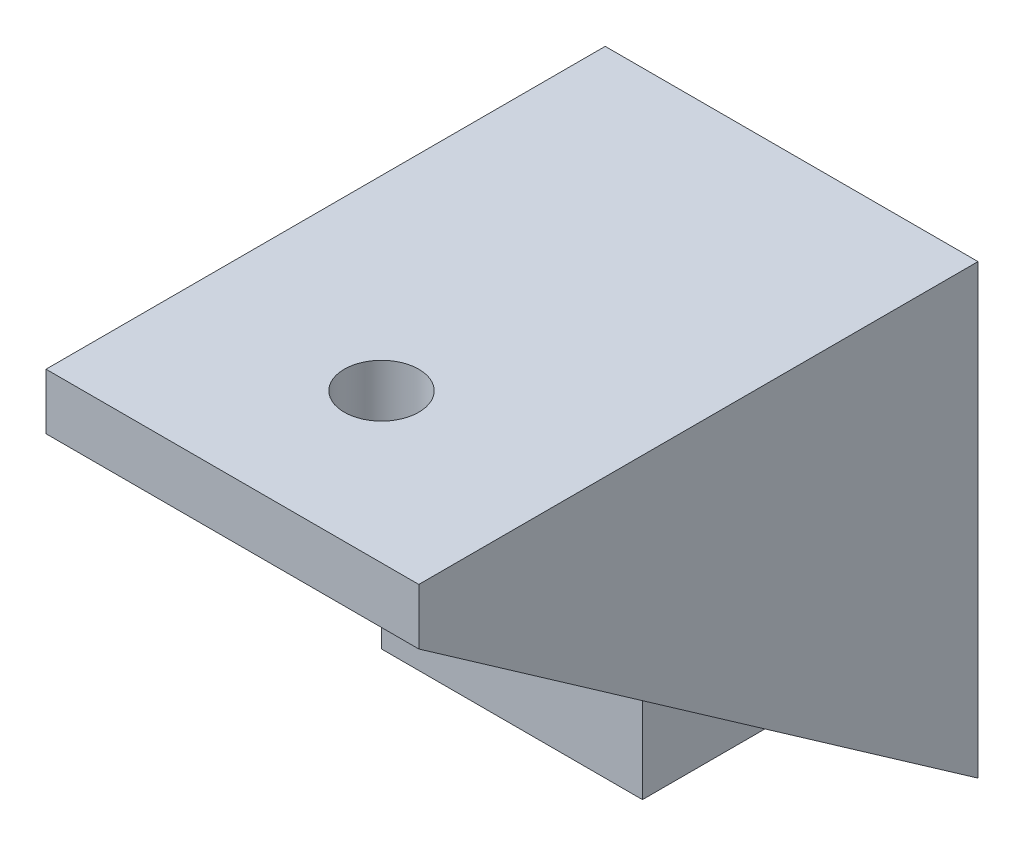
ISO-10303-21;
HEADER;
FILE_DESCRIPTION(('STEP AP214'),'2;1');
FILE_NAME('part.step','',(''),(''),'','','');
FILE_SCHEMA(('AUTOMOTIVE_DESIGN { 1 0 10303 214 1 1 1 1 }'));
ENDSEC;
DATA;
#1=APPLICATION_CONTEXT('core data for automotive mechanical design processes');
#2=APPLICATION_PROTOCOL_DEFINITION('international standard','automotive_design',2000,#1);
#3=PRODUCT_CONTEXT('',#1,'mechanical');
#4=PRODUCT('Part','Part','',(#3));
#5=PRODUCT_RELATED_PRODUCT_CATEGORY('part','',(#4));
#6=PRODUCT_DEFINITION_FORMATION('','',#4);
#7=PRODUCT_DEFINITION_CONTEXT('part definition',#1,'design');
#8=PRODUCT_DEFINITION('design','',#6,#7);
#9=PRODUCT_DEFINITION_SHAPE('','',#8);
#10=(LENGTH_UNIT() NAMED_UNIT(*) SI_UNIT(.MILLI.,.METRE.));
#11=(NAMED_UNIT(*) PLANE_ANGLE_UNIT() SI_UNIT($,.RADIAN.));
#12=(NAMED_UNIT(*) SI_UNIT($,.STERADIAN.) SOLID_ANGLE_UNIT());
#13=UNCERTAINTY_MEASURE_WITH_UNIT(LENGTH_MEASURE(1.E-05),#10,'distance_accuracy_value','');
#14=(GEOMETRIC_REPRESENTATION_CONTEXT(3) GLOBAL_UNCERTAINTY_ASSIGNED_CONTEXT((#13)) GLOBAL_UNIT_ASSIGNED_CONTEXT((#10,
#11,#12)) REPRESENTATION_CONTEXT('',''));
#15=CARTESIAN_POINT('',(0.,0.,0.));
#16=DIRECTION('',(0.,0.,1.));
#17=DIRECTION('',(1.,0.,0.));
#18=AXIS2_PLACEMENT_3D('',#15,#16,#17);
#19=CARTESIAN_POINT('',(0.,0.,3.));
#20=DIRECTION('',(0.,0.,1.));
#21=DIRECTION('',(1.,0.,0.));
#22=AXIS2_PLACEMENT_3D('',#19,#20,#21);
#23=PLANE('',#22);
#24=DIRECTION('',(1.,0.,0.));
#25=VECTOR('',#24,1.);
#26=CARTESIAN_POINT('',(-10.,-9.9,3.));
#27=LINE('',#26,#25);
#28=CARTESIAN_POINT('',(-8.,-9.9,3.));
#29=VERTEX_POINT('',#28);
#30=CARTESIAN_POINT('',(8.,-9.9,3.));
#31=VERTEX_POINT('',#30);
#32=EDGE_CURVE('E192',#29,#31,#27,.T.);
#33=ORIENTED_EDGE('',*,*,#32,.T.);
#34=DIRECTION('',(0.,-1.,0.));
#35=VECTOR('',#34,1.);
#36=CARTESIAN_POINT('',(8.,0.,3.));
#37=LINE('',#36,#35);
#38=CARTESIAN_POINT('',(8.,9.,3.));
#39=VERTEX_POINT('',#38);
#40=EDGE_CURVE('E144',#39,#31,#37,.T.);
#41=ORIENTED_EDGE('',*,*,#40,.F.);
#42=DIRECTION('',(1.,0.,0.));
#43=VECTOR('',#42,1.);
#44=CARTESIAN_POINT('',(0.,9.,3.));
#45=LINE('',#44,#43);
#46=CARTESIAN_POINT('',(-8.,9.,3.));
#47=VERTEX_POINT('',#46);
#48=EDGE_CURVE('E151',#47,#39,#45,.T.);
#49=ORIENTED_EDGE('',*,*,#48,.F.);
#50=DIRECTION('',(0.,-1.,0.));
#51=VECTOR('',#50,1.);
#52=CARTESIAN_POINT('',(-8.,0.,3.));
#53=LINE('',#52,#51);
#54=EDGE_CURVE('E153',#47,#29,#53,.T.);
#55=ORIENTED_EDGE('',*,*,#54,.T.);
#56=EDGE_LOOP('',(#33,#41,#49,#55));
#57=FACE_BOUND('',#56,.T.);
#58=DIRECTION('',(-1.,0.,0.));
#59=VECTOR('',#58,1.);
#60=CARTESIAN_POINT('',(-7.,7.,3.));
#61=LINE('',#60,#59);
#62=CARTESIAN_POINT('',(7.,7.,3.));
#63=VERTEX_POINT('',#62);
#64=CARTESIAN_POINT('',(-7.,7.,3.));
#65=VERTEX_POINT('',#64);
#66=EDGE_CURVE('E271',#63,#65,#61,.T.);
#67=ORIENTED_EDGE('',*,*,#66,.F.);
#68=DIRECTION('',(0.,1.,0.));
#69=VECTOR('',#68,1.);
#70=CARTESIAN_POINT('',(7.,-7.,3.));
#71=LINE('',#70,#69);
#72=CARTESIAN_POINT('',(7.,-7.,3.));
#73=VERTEX_POINT('',#72);
#74=EDGE_CURVE('E139',#73,#63,#71,.T.);
#75=ORIENTED_EDGE('',*,*,#74,.F.);
#76=DIRECTION('',(1.,0.,0.));
#77=VECTOR('',#76,1.);
#78=CARTESIAN_POINT('',(-7.,-7.,3.));
#79=LINE('',#78,#77);
#80=CARTESIAN_POINT('',(-7.,-7.,3.));
#81=VERTEX_POINT('',#80);
#82=EDGE_CURVE('E135',#81,#73,#79,.T.);
#83=ORIENTED_EDGE('',*,*,#82,.F.);
#84=DIRECTION('',(0.,-1.,0.));
#85=VECTOR('',#84,1.);
#86=CARTESIAN_POINT('',(-7.,-7.,3.));
#87=LINE('',#86,#85);
#88=EDGE_CURVE('E273',#65,#81,#87,.T.);
#89=ORIENTED_EDGE('',*,*,#88,.F.);
#90=EDGE_LOOP('',(#67,#75,#83,#89));
#91=FACE_BOUND('',#90,.T.);
#92=ADVANCED_FACE('F32',(#57,#91),#23,.T.);
#93=CARTESIAN_POINT('',(-10.,-12.,0.));
#94=DIRECTION('',(0.,0.81923192051904,-0.573462344363328));
#95=DIRECTION('',(0.,0.573462344363328,0.81923192051904));
#96=AXIS2_PLACEMENT_3D('',#93,#94,#95);
#97=PLANE('',#96);
#98=DIRECTION('',(0.,0.573462344363328,0.81923192051904));
#99=VECTOR('',#98,1.);
#100=CARTESIAN_POINT('',(8.,-12.,0.));
#101=LINE('',#100,#99);
#102=CARTESIAN_POINT('',(7.99999999999999,9.,30.));
#103=VERTEX_POINT('',#102);
#104=EDGE_CURVE('E11',#31,#103,#101,.T.);
#105=ORIENTED_EDGE('',*,*,#104,.F.);
#106=ORIENTED_EDGE('',*,*,#32,.F.);
#107=DIRECTION('',(0.,0.573462344363328,0.81923192051904));
#108=VECTOR('',#107,1.);
#109=CARTESIAN_POINT('',(-8.,-12.,0.));
#110=LINE('',#109,#108);
#111=CARTESIAN_POINT('',(-8.,9.,30.));
#112=VERTEX_POINT('',#111);
#113=EDGE_CURVE('E41',#29,#112,#110,.T.);
#114=ORIENTED_EDGE('',*,*,#113,.T.);
#115=DIRECTION('',(1.,0.,0.));
#116=VECTOR('',#115,1.);
#117=CARTESIAN_POINT('',(-10.,9.,30.));
#118=LINE('',#117,#116);
#119=CARTESIAN_POINT('',(-10.,9.,30.));
#120=VERTEX_POINT('',#119);
#121=EDGE_CURVE('E166',#120,#112,#118,.T.);
#122=ORIENTED_EDGE('',*,*,#121,.F.);
#123=DIRECTION('',(0.,0.573462344363328,0.81923192051904));
#124=VECTOR('',#123,1.);
#125=CARTESIAN_POINT('',(-10.,-12.,0.));
#126=LINE('',#125,#124);
#127=CARTESIAN_POINT('',(-10.,-12.,0.));
#128=VERTEX_POINT('',#127);
#129=EDGE_CURVE('E160',#128,#120,#126,.T.);
#130=ORIENTED_EDGE('',*,*,#129,.F.);
#131=DIRECTION('',(1.,0.,0.));
#132=VECTOR('',#131,1.);
#133=CARTESIAN_POINT('',(-10.,-12.,0.));
#134=LINE('',#133,#132);
#135=CARTESIAN_POINT('',(10.,-12.,0.));
#136=VERTEX_POINT('',#135);
#137=EDGE_CURVE('E173',#128,#136,#134,.T.);
#138=ORIENTED_EDGE('',*,*,#137,.T.);
#139=DIRECTION('',(0.,0.573462344363328,0.81923192051904));
#140=VECTOR('',#139,1.);
#141=CARTESIAN_POINT('',(10.,-12.,0.));
#142=LINE('',#141,#140);
#143=CARTESIAN_POINT('',(10.,9.,30.));
#144=VERTEX_POINT('',#143);
#145=EDGE_CURVE('E158',#136,#144,#142,.T.);
#146=ORIENTED_EDGE('',*,*,#145,.T.);
#147=EDGE_CURVE('E163',#103,#144,#118,.T.);
#148=ORIENTED_EDGE('',*,*,#147,.F.);
#149=EDGE_LOOP('',(#105,#106,#114,#122,#130,#138,#146,#148));
#150=FACE_BOUND('',#149,.T.);
#151=ADVANCED_FACE('F198',(#150),#97,.F.);
#152=CARTESIAN_POINT('',(10.,-12.,30.));
#153=DIRECTION('',(-1.,0.,0.));
#154=DIRECTION('',(0.,0.,1.));
#155=AXIS2_PLACEMENT_3D('',#152,#153,#154);
#156=PLANE('',#155);
#157=DIRECTION('',(0.,1.,0.));
#158=VECTOR('',#157,1.);
#159=CARTESIAN_POINT('',(10.,-12.,30.));
#160=LINE('',#159,#158);
#161=CARTESIAN_POINT('',(10.,12.,30.));
#162=VERTEX_POINT('',#161);
#163=EDGE_CURVE('E170',#144,#162,#160,.T.);
#164=ORIENTED_EDGE('',*,*,#163,.F.);
#165=ORIENTED_EDGE('',*,*,#145,.F.);
#166=DIRECTION('',(0.,1.,0.));
#167=VECTOR('',#166,1.);
#168=CARTESIAN_POINT('',(10.,-12.,0.));
#169=LINE('',#168,#167);
#170=CARTESIAN_POINT('',(10.,12.,0.));
#171=VERTEX_POINT('',#170);
#172=EDGE_CURVE('E169',#136,#171,#169,.T.);
#173=ORIENTED_EDGE('',*,*,#172,.T.);
#174=DIRECTION('',(0.,0.,-1.));
#175=VECTOR('',#174,1.);
#176=CARTESIAN_POINT('',(10.,12.,30.));
#177=LINE('',#176,#175);
#178=EDGE_CURVE('E189',#162,#171,#177,.T.);
#179=ORIENTED_EDGE('',*,*,#178,.F.);
#180=EDGE_LOOP('',(#164,#165,#173,#179));
#181=FACE_BOUND('',#180,.T.);
#182=ADVANCED_FACE('F34',(#181),#156,.F.);
#183=CARTESIAN_POINT('',(-10.,12.,30.));
#184=DIRECTION('',(0.,-1.,0.));
#185=DIRECTION('',(0.,0.,-1.));
#186=AXIS2_PLACEMENT_3D('',#183,#184,#185);
#187=PLANE('',#186);
#188=CARTESIAN_POINT('',(0.,12.,22.));
#189=DIRECTION('',(0.,-1.,0.));
#190=DIRECTION('',(0.,0.,-1.));
#191=AXIS2_PLACEMENT_3D('',#188,#189,#190);
#192=CIRCLE('',#191,2.);
#193=CARTESIAN_POINT('',(0.,12.,20.));
#194=VERTEX_POINT('',#193);
#195=EDGE_CURVE('E260',#194,#194,#192,.T.);
#196=ORIENTED_EDGE('',*,*,#195,.T.);
#197=EDGE_LOOP('',(#196));
#198=FACE_BOUND('',#197,.T.);
#199=DIRECTION('',(-1.,0.,0.));
#200=VECTOR('',#199,1.);
#201=CARTESIAN_POINT('',(-10.,12.,0.));
#202=LINE('',#201,#200);
#203=CARTESIAN_POINT('',(-10.,12.,0.));
#204=VERTEX_POINT('',#203);
#205=EDGE_CURVE('E181',#171,#204,#202,.T.);
#206=ORIENTED_EDGE('',*,*,#205,.T.);
#207=DIRECTION('',(0.,0.,-1.));
#208=VECTOR('',#207,1.);
#209=CARTESIAN_POINT('',(-10.,12.,30.));
#210=LINE('',#209,#208);
#211=CARTESIAN_POINT('',(-10.,12.,30.));
#212=VERTEX_POINT('',#211);
#213=EDGE_CURVE('E178',#212,#204,#210,.T.);
#214=ORIENTED_EDGE('',*,*,#213,.F.);
#215=DIRECTION('',(-1.,0.,0.));
#216=VECTOR('',#215,1.);
#217=CARTESIAN_POINT('',(-10.,12.,30.));
#218=LINE('',#217,#216);
#219=EDGE_CURVE('E172',#162,#212,#218,.T.);
#220=ORIENTED_EDGE('',*,*,#219,.F.);
#221=ORIENTED_EDGE('',*,*,#178,.T.);
#222=EDGE_LOOP('',(#206,#214,#220,#221));
#223=FACE_BOUND('',#222,.T.);
#224=ADVANCED_FACE('F219',(#198,#223),#187,.F.);
#225=CARTESIAN_POINT('',(-10.,-12.,30.));
#226=DIRECTION('',(1.,0.,0.));
#227=DIRECTION('',(0.,0.,-1.));
#228=AXIS2_PLACEMENT_3D('',#225,#226,#227);
#229=PLANE('',#228);
#230=DIRECTION('',(0.,-1.,0.));
#231=VECTOR('',#230,1.);
#232=CARTESIAN_POINT('',(-10.,-12.,0.));
#233=LINE('',#232,#231);
#234=EDGE_CURVE('E183',#204,#128,#233,.T.);
#235=ORIENTED_EDGE('',*,*,#234,.T.);
#236=ORIENTED_EDGE('',*,*,#129,.T.);
#237=DIRECTION('',(0.,-1.,0.));
#238=VECTOR('',#237,1.);
#239=CARTESIAN_POINT('',(-10.,-12.,30.));
#240=LINE('',#239,#238);
#241=EDGE_CURVE('E175',#212,#120,#240,.T.);
#242=ORIENTED_EDGE('',*,*,#241,.F.);
#243=ORIENTED_EDGE('',*,*,#213,.T.);
#244=EDGE_LOOP('',(#235,#236,#242,#243));
#245=FACE_BOUND('',#244,.T.);
#246=ADVANCED_FACE('F207',(#245),#229,.F.);
#247=CARTESIAN_POINT('',(0.,0.,30.));
#248=DIRECTION('',(0.,0.,-1.));
#249=DIRECTION('',(-1.,0.,0.));
#250=AXIS2_PLACEMENT_3D('',#247,#248,#249);
#251=PLANE('',#250);
#252=ORIENTED_EDGE('',*,*,#241,.T.);
#253=ORIENTED_EDGE('',*,*,#121,.T.);
#254=DIRECTION('',(1.,0.,0.));
#255=VECTOR('',#254,1.);
#256=CARTESIAN_POINT('',(0.,9.,30.));
#257=LINE('',#256,#255);
#258=EDGE_CURVE('E141',#112,#103,#257,.T.);
#259=ORIENTED_EDGE('',*,*,#258,.T.);
#260=ORIENTED_EDGE('',*,*,#147,.T.);
#261=ORIENTED_EDGE('',*,*,#163,.T.);
#262=ORIENTED_EDGE('',*,*,#219,.T.);
#263=EDGE_LOOP('',(#252,#253,#259,#260,#261,#262));
#264=FACE_BOUND('',#263,.T.);
#265=ADVANCED_FACE('F202',(#264),#251,.F.);
#266=CARTESIAN_POINT('',(0.,0.,0.));
#267=DIRECTION('',(0.,0.,-1.));
#268=DIRECTION('',(-1.,0.,0.));
#269=AXIS2_PLACEMENT_3D('',#266,#267,#268);
#270=PLANE('',#269);
#271=CARTESIAN_POINT('',(0.,0.,0.));
#272=DIRECTION('',(0.,0.,-1.));
#273=DIRECTION('',(-1.,0.,0.));
#274=AXIS2_PLACEMENT_3D('',#271,#272,#273);
#275=CIRCLE('',#274,1.6);
#276=CARTESIAN_POINT('',(-1.6,0.,0.));
#277=VERTEX_POINT('',#276);
#278=EDGE_CURVE('E258',#277,#277,#275,.T.);
#279=ORIENTED_EDGE('',*,*,#278,.F.);
#280=EDGE_LOOP('',(#279));
#281=FACE_BOUND('',#280,.T.);
#282=ORIENTED_EDGE('',*,*,#172,.F.);
#283=ORIENTED_EDGE('',*,*,#137,.F.);
#284=ORIENTED_EDGE('',*,*,#234,.F.);
#285=ORIENTED_EDGE('',*,*,#205,.F.);
#286=EDGE_LOOP('',(#282,#283,#284,#285));
#287=FACE_BOUND('',#286,.T.);
#288=ADVANCED_FACE('F217',(#281,#287),#270,.T.);
#289=CARTESIAN_POINT('',(8.,0.,3.));
#290=DIRECTION('',(-1.,0.,0.));
#291=DIRECTION('',(0.,-1.,0.));
#292=AXIS2_PLACEMENT_3D('',#289,#290,#291);
#293=PLANE('',#292);
#294=ORIENTED_EDGE('',*,*,#104,.T.);
#295=DIRECTION('',(0.,0.,1.));
#296=VECTOR('',#295,1.);
#297=CARTESIAN_POINT('',(8.,9.,3.));
#298=LINE('',#297,#296);
#299=EDGE_CURVE('E56',#39,#103,#298,.T.);
#300=ORIENTED_EDGE('',*,*,#299,.F.);
#301=ORIENTED_EDGE('',*,*,#40,.T.);
#302=EDGE_LOOP('',(#294,#300,#301));
#303=FACE_BOUND('',#302,.T.);
#304=ADVANCED_FACE('F243',(#303),#293,.T.);
#305=CARTESIAN_POINT('',(-8.,0.,3.));
#306=DIRECTION('',(-1.,0.,0.));
#307=DIRECTION('',(0.,-1.,0.));
#308=AXIS2_PLACEMENT_3D('',#305,#306,#307);
#309=PLANE('',#308);
#310=ORIENTED_EDGE('',*,*,#54,.F.);
#311=DIRECTION('',(0.,0.,1.));
#312=VECTOR('',#311,1.);
#313=CARTESIAN_POINT('',(-8.,9.,3.));
#314=LINE('',#313,#312);
#315=EDGE_CURVE('E156',#47,#112,#314,.T.);
#316=ORIENTED_EDGE('',*,*,#315,.T.);
#317=ORIENTED_EDGE('',*,*,#113,.F.);
#318=EDGE_LOOP('',(#310,#316,#317));
#319=FACE_BOUND('',#318,.T.);
#320=ADVANCED_FACE('F239',(#319),#309,.F.);
#321=CARTESIAN_POINT('',(0.,9.,3.));
#322=DIRECTION('',(0.,-1.,0.));
#323=DIRECTION('',(0.,0.,-1.));
#324=AXIS2_PLACEMENT_3D('',#321,#322,#323);
#325=PLANE('',#324);
#326=CARTESIAN_POINT('',(0.,9.,22.));
#327=DIRECTION('',(0.,-1.,0.));
#328=DIRECTION('',(0.,0.,-1.));
#329=AXIS2_PLACEMENT_3D('',#326,#327,#328);
#330=CIRCLE('',#329,2.);
#331=CARTESIAN_POINT('',(0.,9.,20.));
#332=VERTEX_POINT('',#331);
#333=EDGE_CURVE('E263',#332,#332,#330,.T.);
#334=ORIENTED_EDGE('',*,*,#333,.F.);
#335=EDGE_LOOP('',(#334));
#336=FACE_BOUND('',#335,.T.);
#337=ORIENTED_EDGE('',*,*,#258,.F.);
#338=ORIENTED_EDGE('',*,*,#315,.F.);
#339=ORIENTED_EDGE('',*,*,#48,.T.);
#340=ORIENTED_EDGE('',*,*,#299,.T.);
#341=EDGE_LOOP('',(#337,#338,#339,#340));
#342=FACE_BOUND('',#341,.T.);
#343=ADVANCED_FACE('F242',(#336,#342),#325,.T.);
#344=CARTESIAN_POINT('',(7.,-7.,15.));
#345=DIRECTION('',(-1.,0.,0.));
#346=DIRECTION('',(0.,0.,1.));
#347=AXIS2_PLACEMENT_3D('',#344,#345,#346);
#348=PLANE('',#347);
#349=ORIENTED_EDGE('',*,*,#74,.T.);
#350=DIRECTION('',(0.,0.,-1.));
#351=VECTOR('',#350,1.);
#352=CARTESIAN_POINT('',(7.,7.,15.));
#353=LINE('',#352,#351);
#354=CARTESIAN_POINT('',(7.,7.,15.));
#355=VERTEX_POINT('',#354);
#356=EDGE_CURVE('E120',#355,#63,#353,.T.);
#357=ORIENTED_EDGE('',*,*,#356,.F.);
#358=DIRECTION('',(0.,1.,0.));
#359=VECTOR('',#358,1.);
#360=CARTESIAN_POINT('',(7.,-7.,15.));
#361=LINE('',#360,#359);
#362=CARTESIAN_POINT('',(7.,-7.,15.));
#363=VERTEX_POINT('',#362);
#364=EDGE_CURVE('E127',#363,#355,#361,.T.);
#365=ORIENTED_EDGE('',*,*,#364,.F.);
#366=DIRECTION('',(0.,0.,-1.));
#367=VECTOR('',#366,1.);
#368=CARTESIAN_POINT('',(7.,-7.,15.));
#369=LINE('',#368,#367);
#370=EDGE_CURVE('E269',#363,#73,#369,.T.);
#371=ORIENTED_EDGE('',*,*,#370,.T.);
#372=EDGE_LOOP('',(#349,#357,#365,#371));
#373=FACE_BOUND('',#372,.T.);
#374=ADVANCED_FACE('F137',(#373),#348,.F.);
#375=CARTESIAN_POINT('',(-7.,7.,15.));
#376=DIRECTION('',(0.,-1.,0.));
#377=DIRECTION('',(0.,0.,-1.));
#378=AXIS2_PLACEMENT_3D('',#375,#376,#377);
#379=PLANE('',#378);
#380=ORIENTED_EDGE('',*,*,#66,.T.);
#381=DIRECTION('',(0.,0.,-1.));
#382=VECTOR('',#381,1.);
#383=CARTESIAN_POINT('',(-7.,7.,15.));
#384=LINE('',#383,#382);
#385=CARTESIAN_POINT('',(-7.,7.,15.));
#386=VERTEX_POINT('',#385);
#387=EDGE_CURVE('E123',#386,#65,#384,.T.);
#388=ORIENTED_EDGE('',*,*,#387,.F.);
#389=DIRECTION('',(-1.,0.,0.));
#390=VECTOR('',#389,1.);
#391=CARTESIAN_POINT('',(-7.,7.,15.));
#392=LINE('',#391,#390);
#393=EDGE_CURVE('E116',#355,#386,#392,.T.);
#394=ORIENTED_EDGE('',*,*,#393,.F.);
#395=ORIENTED_EDGE('',*,*,#356,.T.);
#396=EDGE_LOOP('',(#380,#388,#394,#395));
#397=FACE_BOUND('',#396,.T.);
#398=ADVANCED_FACE('F118',(#397),#379,.F.);
#399=CARTESIAN_POINT('',(-7.,-7.,15.));
#400=DIRECTION('',(1.,0.,0.));
#401=DIRECTION('',(0.,0.,-1.));
#402=AXIS2_PLACEMENT_3D('',#399,#400,#401);
#403=PLANE('',#402);
#404=ORIENTED_EDGE('',*,*,#88,.T.);
#405=DIRECTION('',(0.,0.,-1.));
#406=VECTOR('',#405,1.);
#407=CARTESIAN_POINT('',(-7.,-7.,15.));
#408=LINE('',#407,#406);
#409=CARTESIAN_POINT('',(-7.,-7.,15.));
#410=VERTEX_POINT('',#409);
#411=EDGE_CURVE('E48',#410,#81,#408,.T.);
#412=ORIENTED_EDGE('',*,*,#411,.F.);
#413=DIRECTION('',(0.,-1.,0.));
#414=VECTOR('',#413,1.);
#415=CARTESIAN_POINT('',(-7.,-7.,15.));
#416=LINE('',#415,#414);
#417=EDGE_CURVE('E126',#386,#410,#416,.T.);
#418=ORIENTED_EDGE('',*,*,#417,.F.);
#419=ORIENTED_EDGE('',*,*,#387,.T.);
#420=EDGE_LOOP('',(#404,#412,#418,#419));
#421=FACE_BOUND('',#420,.T.);
#422=ADVANCED_FACE('F279',(#421),#403,.F.);
#423=CARTESIAN_POINT('',(-7.,-7.,15.));
#424=DIRECTION('',(0.,1.,0.));
#425=DIRECTION('',(-1.,0.,0.));
#426=AXIS2_PLACEMENT_3D('',#423,#424,#425);
#427=PLANE('',#426);
#428=ORIENTED_EDGE('',*,*,#82,.T.);
#429=ORIENTED_EDGE('',*,*,#370,.F.);
#430=DIRECTION('',(1.,0.,0.));
#431=VECTOR('',#430,1.);
#432=CARTESIAN_POINT('',(-7.,-7.,15.));
#433=LINE('',#432,#431);
#434=EDGE_CURVE('E131',#410,#363,#433,.T.);
#435=ORIENTED_EDGE('',*,*,#434,.F.);
#436=ORIENTED_EDGE('',*,*,#411,.T.);
#437=EDGE_LOOP('',(#428,#429,#435,#436));
#438=FACE_BOUND('',#437,.T.);
#439=ADVANCED_FACE('F280',(#438),#427,.F.);
#440=CARTESIAN_POINT('',(0.,0.,15.));
#441=DIRECTION('',(0.,0.,-1.));
#442=DIRECTION('',(-1.,0.,0.));
#443=AXIS2_PLACEMENT_3D('',#440,#441,#442);
#444=PLANE('',#443);
#445=CARTESIAN_POINT('',(0.,0.,15.));
#446=DIRECTION('',(0.,0.,-1.));
#447=DIRECTION('',(-1.,0.,0.));
#448=AXIS2_PLACEMENT_3D('',#445,#446,#447);
#449=CIRCLE('',#448,1.6);
#450=CARTESIAN_POINT('',(-1.6,0.,15.));
#451=VERTEX_POINT('',#450);
#452=EDGE_CURVE('E36',#451,#451,#449,.T.);
#453=ORIENTED_EDGE('',*,*,#452,.T.);
#454=EDGE_LOOP('',(#453));
#455=FACE_BOUND('',#454,.T.);
#456=ORIENTED_EDGE('',*,*,#364,.T.);
#457=ORIENTED_EDGE('',*,*,#393,.T.);
#458=ORIENTED_EDGE('',*,*,#417,.T.);
#459=ORIENTED_EDGE('',*,*,#434,.T.);
#460=EDGE_LOOP('',(#456,#457,#458,#459));
#461=FACE_BOUND('',#460,.T.);
#462=ADVANCED_FACE('F130',(#455,#461),#444,.F.);
#463=CARTESIAN_POINT('',(0.,0.,30.));
#464=DIRECTION('',(0.,0.,-1.));
#465=DIRECTION('',(-1.,0.,0.));
#466=AXIS2_PLACEMENT_3D('',#463,#464,#465);
#467=CYLINDRICAL_SURFACE('',#466,1.6);
#468=ORIENTED_EDGE('',*,*,#278,.T.);
#469=EDGE_LOOP('',(#468));
#470=FACE_BOUND('',#469,.T.);
#471=ORIENTED_EDGE('',*,*,#452,.F.);
#472=EDGE_LOOP('',(#471));
#473=FACE_BOUND('',#472,.T.);
#474=ADVANCED_FACE('F287',(#470,#473),#467,.F.);
#475=CARTESIAN_POINT('',(0.,12.,22.));
#476=DIRECTION('',(0.,-1.,0.));
#477=DIRECTION('',(0.,0.,-1.));
#478=AXIS2_PLACEMENT_3D('',#475,#476,#477);
#479=CYLINDRICAL_SURFACE('',#478,2.);
#480=ORIENTED_EDGE('',*,*,#195,.F.);
#481=EDGE_LOOP('',(#480));
#482=FACE_BOUND('',#481,.T.);
#483=ORIENTED_EDGE('',*,*,#333,.T.);
#484=EDGE_LOOP('',(#483));
#485=FACE_BOUND('',#484,.T.);
#486=ADVANCED_FACE('F349',(#482,#485),#479,.F.);
#487=CLOSED_SHELL('',(#92,#151,#182,#224,#246,#265,#288,#304,#320,#343,#374,#398,#422,#439,#462,
#474,#486));
#488=MANIFOLD_SOLID_BREP('B2',#487);
#489=ADVANCED_BREP_SHAPE_REPRESENTATION('',(#18,#488),#14);
#490=SHAPE_DEFINITION_REPRESENTATION(#9,#489);
ENDSEC;
END-ISO-10303-21;
